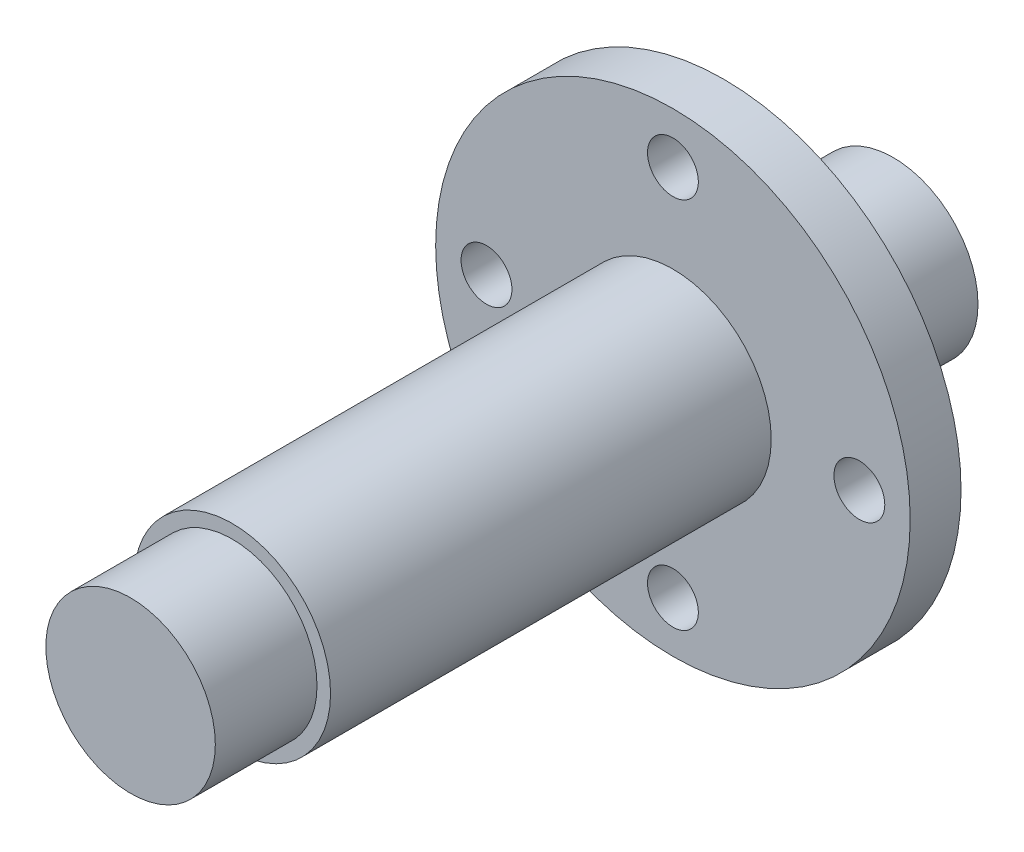
ISO-10303-21;
HEADER;
FILE_DESCRIPTION(('STEP AP214'),'2;1');
FILE_NAME('part.step','',(''),(''),'','','');
FILE_SCHEMA(('AUTOMOTIVE_DESIGN { 1 0 10303 214 1 1 1 1 }'));
ENDSEC;
DATA;
#1=APPLICATION_CONTEXT('core data for automotive mechanical design processes');
#2=APPLICATION_PROTOCOL_DEFINITION('international standard','automotive_design',2000,#1);
#3=PRODUCT_CONTEXT('',#1,'mechanical');
#4=PRODUCT('Part','Part','',(#3));
#5=PRODUCT_RELATED_PRODUCT_CATEGORY('part','',(#4));
#6=PRODUCT_DEFINITION_FORMATION('','',#4);
#7=PRODUCT_DEFINITION_CONTEXT('part definition',#1,'design');
#8=PRODUCT_DEFINITION('design','',#6,#7);
#9=PRODUCT_DEFINITION_SHAPE('','',#8);
#10=(LENGTH_UNIT() NAMED_UNIT(*) SI_UNIT(.MILLI.,.METRE.));
#11=(NAMED_UNIT(*) PLANE_ANGLE_UNIT() SI_UNIT($,.RADIAN.));
#12=(NAMED_UNIT(*) SI_UNIT($,.STERADIAN.) SOLID_ANGLE_UNIT());
#13=UNCERTAINTY_MEASURE_WITH_UNIT(LENGTH_MEASURE(1.E-05),#10,'distance_accuracy_value','');
#14=(GEOMETRIC_REPRESENTATION_CONTEXT(3) GLOBAL_UNCERTAINTY_ASSIGNED_CONTEXT((#13)) GLOBAL_UNIT_ASSIGNED_CONTEXT((#10,
#11,#12)) REPRESENTATION_CONTEXT('',''));
#15=CARTESIAN_POINT('',(0.,0.,0.));
#16=DIRECTION('',(0.,0.,1.));
#17=DIRECTION('',(1.,0.,0.));
#18=AXIS2_PLACEMENT_3D('',#15,#16,#17);
#19=CARTESIAN_POINT('',(0.,0.,6.));
#20=DIRECTION('',(0.,0.,-1.));
#21=DIRECTION('',(-1.,0.,0.));
#22=AXIS2_PLACEMENT_3D('',#19,#20,#21);
#23=CYLINDRICAL_SURFACE('',#22,5.);
#24=CARTESIAN_POINT('',(0.,0.,6.));
#25=DIRECTION('',(0.,0.,1.));
#26=DIRECTION('',(1.,0.,0.));
#27=AXIS2_PLACEMENT_3D('',#24,#25,#26);
#28=CIRCLE('',#27,5.);
#29=CARTESIAN_POINT('',(5.,0.,6.));
#30=VERTEX_POINT('',#29);
#31=EDGE_CURVE('E51',#30,#30,#28,.T.);
#32=ORIENTED_EDGE('',*,*,#31,.F.);
#33=EDGE_LOOP('',(#32));
#34=FACE_BOUND('',#33,.T.);
#35=CARTESIAN_POINT('',(0.,0.,0.));
#36=DIRECTION('',(0.,0.,1.));
#37=DIRECTION('',(1.,0.,0.));
#38=AXIS2_PLACEMENT_3D('',#35,#36,#37);
#39=CIRCLE('',#38,5.);
#40=CARTESIAN_POINT('',(5.,0.,0.));
#41=VERTEX_POINT('',#40);
#42=EDGE_CURVE('E40',#41,#41,#39,.T.);
#43=ORIENTED_EDGE('',*,*,#42,.T.);
#44=EDGE_LOOP('',(#43));
#45=FACE_BOUND('',#44,.T.);
#46=ADVANCED_FACE('F37',(#34,#45),#23,.T.);
#47=CARTESIAN_POINT('',(0.,0.,0.));
#48=DIRECTION('',(0.,0.,1.));
#49=DIRECTION('',(1.,0.,0.));
#50=AXIS2_PLACEMENT_3D('',#47,#48,#49);
#51=PLANE('',#50);
#52=ORIENTED_EDGE('',*,*,#42,.F.);
#53=EDGE_LOOP('',(#52));
#54=FACE_BOUND('',#53,.T.);
#55=ADVANCED_FACE('F85',(#54),#51,.F.);
#56=CARTESIAN_POINT('',(0.,0.,10.));
#57=DIRECTION('',(0.,0.,-1.));
#58=DIRECTION('',(-1.,0.,0.));
#59=AXIS2_PLACEMENT_3D('',#56,#57,#58);
#60=CYLINDRICAL_SURFACE('',#59,5.8);
#61=CARTESIAN_POINT('',(0.,0.,10.));
#62=DIRECTION('',(0.,0.,1.));
#63=DIRECTION('',(1.,0.,0.));
#64=AXIS2_PLACEMENT_3D('',#61,#62,#63);
#65=CIRCLE('',#64,5.8);
#66=CARTESIAN_POINT('',(5.8,0.,10.));
#67=VERTEX_POINT('',#66);
#68=EDGE_CURVE('E70',#67,#67,#65,.T.);
#69=ORIENTED_EDGE('',*,*,#68,.F.);
#70=EDGE_LOOP('',(#69));
#71=FACE_BOUND('',#70,.T.);
#72=CARTESIAN_POINT('',(0.,0.,6.));
#73=DIRECTION('',(0.,0.,1.));
#74=DIRECTION('',(1.,0.,0.));
#75=AXIS2_PLACEMENT_3D('',#72,#73,#74);
#76=CIRCLE('',#75,5.8);
#77=CARTESIAN_POINT('',(5.8,0.,6.));
#78=VERTEX_POINT('',#77);
#79=EDGE_CURVE('E66',#78,#78,#76,.T.);
#80=ORIENTED_EDGE('',*,*,#79,.T.);
#81=EDGE_LOOP('',(#80));
#82=FACE_BOUND('',#81,.T.);
#83=ADVANCED_FACE('F87',(#71,#82),#60,.T.);
#84=CARTESIAN_POINT('',(0.,0.,6.));
#85=DIRECTION('',(0.,0.,1.));
#86=DIRECTION('',(1.,0.,0.));
#87=AXIS2_PLACEMENT_3D('',#84,#85,#86);
#88=PLANE('',#87);
#89=ORIENTED_EDGE('',*,*,#31,.T.);
#90=EDGE_LOOP('',(#89));
#91=FACE_BOUND('',#90,.T.);
#92=ORIENTED_EDGE('',*,*,#79,.F.);
#93=EDGE_LOOP('',(#92));
#94=FACE_BOUND('',#93,.T.);
#95=ADVANCED_FACE('F92',(#91,#94),#88,.F.);
#96=CARTESIAN_POINT('',(0.,0.,13.));
#97=DIRECTION('',(0.,0.,-1.));
#98=DIRECTION('',(-1.,0.,0.));
#99=AXIS2_PLACEMENT_3D('',#96,#97,#98);
#100=CYLINDRICAL_SURFACE('',#99,14.);
#101=CARTESIAN_POINT('',(0.,0.,13.));
#102=DIRECTION('',(0.,0.,1.));
#103=DIRECTION('',(1.,0.,0.));
#104=AXIS2_PLACEMENT_3D('',#101,#102,#103);
#105=CIRCLE('',#104,14.);
#106=CARTESIAN_POINT('',(14.,0.,13.));
#107=VERTEX_POINT('',#106);
#108=EDGE_CURVE('E62',#107,#107,#105,.T.);
#109=ORIENTED_EDGE('',*,*,#108,.F.);
#110=EDGE_LOOP('',(#109));
#111=FACE_BOUND('',#110,.T.);
#112=CARTESIAN_POINT('',(0.,0.,10.));
#113=DIRECTION('',(0.,0.,1.));
#114=DIRECTION('',(1.,0.,0.));
#115=AXIS2_PLACEMENT_3D('',#112,#113,#114);
#116=CIRCLE('',#115,14.);
#117=CARTESIAN_POINT('',(14.,0.,10.));
#118=VERTEX_POINT('',#117);
#119=EDGE_CURVE('E60',#118,#118,#116,.T.);
#120=ORIENTED_EDGE('',*,*,#119,.T.);
#121=EDGE_LOOP('',(#120));
#122=FACE_BOUND('',#121,.T.);
#123=ADVANCED_FACE('F99',(#111,#122),#100,.T.);
#124=CARTESIAN_POINT('',(0.,0.,13.));
#125=DIRECTION('',(0.,0.,1.));
#126=DIRECTION('',(1.,0.,0.));
#127=AXIS2_PLACEMENT_3D('',#124,#125,#126);
#128=PLANE('',#127);
#129=CARTESIAN_POINT('',(-11.,0.,13.));
#130=DIRECTION('',(0.,0.,1.));
#131=DIRECTION('',(1.,0.,0.));
#132=AXIS2_PLACEMENT_3D('',#129,#130,#131);
#133=CIRCLE('',#132,1.5);
#134=CARTESIAN_POINT('',(-9.5,0.,13.));
#135=VERTEX_POINT('',#134);
#136=EDGE_CURVE('E147',#135,#135,#133,.T.);
#137=ORIENTED_EDGE('',*,*,#136,.F.);
#138=EDGE_LOOP('',(#137));
#139=FACE_BOUND('',#138,.T.);
#140=CARTESIAN_POINT('',(0.,-11.,13.));
#141=DIRECTION('',(0.,0.,1.));
#142=DIRECTION('',(1.,0.,0.));
#143=AXIS2_PLACEMENT_3D('',#140,#141,#142);
#144=CIRCLE('',#143,1.5);
#145=CARTESIAN_POINT('',(1.50000000000004,-11.,13.));
#146=VERTEX_POINT('',#145);
#147=EDGE_CURVE('E174',#146,#146,#144,.T.);
#148=ORIENTED_EDGE('',*,*,#147,.F.);
#149=EDGE_LOOP('',(#148));
#150=FACE_BOUND('',#149,.T.);
#151=CARTESIAN_POINT('',(11.,0.,13.));
#152=DIRECTION('',(0.,0.,1.));
#153=DIRECTION('',(1.,0.,0.));
#154=AXIS2_PLACEMENT_3D('',#151,#152,#153);
#155=CIRCLE('',#154,1.5);
#156=CARTESIAN_POINT('',(12.5,0.,13.));
#157=VERTEX_POINT('',#156);
#158=EDGE_CURVE('E158',#157,#157,#155,.T.);
#159=ORIENTED_EDGE('',*,*,#158,.F.);
#160=EDGE_LOOP('',(#159));
#161=FACE_BOUND('',#160,.T.);
#162=CARTESIAN_POINT('',(-1.15218884181823E-13,11.,13.));
#163=DIRECTION('',(0.,0.,1.));
#164=DIRECTION('',(1.,0.,0.));
#165=AXIS2_PLACEMENT_3D('',#162,#163,#164);
#166=CIRCLE('',#165,1.5);
#167=CARTESIAN_POINT('',(1.49999999999989,11.,13.));
#168=VERTEX_POINT('',#167);
#169=EDGE_CURVE('E152',#168,#168,#166,.T.);
#170=ORIENTED_EDGE('',*,*,#169,.F.);
#171=EDGE_LOOP('',(#170));
#172=FACE_BOUND('',#171,.T.);
#173=CARTESIAN_POINT('',(0.,0.,13.));
#174=DIRECTION('',(0.,0.,1.));
#175=DIRECTION('',(1.,0.,0.));
#176=AXIS2_PLACEMENT_3D('',#173,#174,#175);
#177=CIRCLE('',#176,5.8);
#178=CARTESIAN_POINT('',(5.8,0.,13.));
#179=VERTEX_POINT('',#178);
#180=EDGE_CURVE('E45',#179,#179,#177,.T.);
#181=ORIENTED_EDGE('',*,*,#180,.F.);
#182=EDGE_LOOP('',(#181));
#183=FACE_BOUND('',#182,.T.);
#184=ORIENTED_EDGE('',*,*,#108,.T.);
#185=EDGE_LOOP('',(#184));
#186=FACE_BOUND('',#185,.T.);
#187=ADVANCED_FACE('F102',(#139,#150,#161,#172,#183,#186),#128,.T.);
#188=CARTESIAN_POINT('',(0.,0.,10.));
#189=DIRECTION('',(0.,0.,1.));
#190=DIRECTION('',(1.,0.,0.));
#191=AXIS2_PLACEMENT_3D('',#188,#189,#190);
#192=PLANE('',#191);
#193=CARTESIAN_POINT('',(-11.,0.,10.));
#194=DIRECTION('',(0.,0.,-1.));
#195=DIRECTION('',(-1.,0.,0.));
#196=AXIS2_PLACEMENT_3D('',#193,#194,#195);
#197=CIRCLE('',#196,1.5);
#198=CARTESIAN_POINT('',(-12.5,0.,10.));
#199=VERTEX_POINT('',#198);
#200=EDGE_CURVE('E150',#199,#199,#197,.T.);
#201=ORIENTED_EDGE('',*,*,#200,.F.);
#202=EDGE_LOOP('',(#201));
#203=FACE_BOUND('',#202,.T.);
#204=CARTESIAN_POINT('',(0.,-11.,10.));
#205=DIRECTION('',(0.,0.,-1.));
#206=DIRECTION('',(-1.,0.,0.));
#207=AXIS2_PLACEMENT_3D('',#204,#205,#206);
#208=CIRCLE('',#207,1.5);
#209=CARTESIAN_POINT('',(-1.49999999999996,-11.,10.));
#210=VERTEX_POINT('',#209);
#211=EDGE_CURVE('E153',#210,#210,#208,.T.);
#212=ORIENTED_EDGE('',*,*,#211,.F.);
#213=EDGE_LOOP('',(#212));
#214=FACE_BOUND('',#213,.T.);
#215=CARTESIAN_POINT('',(11.,0.,10.));
#216=DIRECTION('',(0.,0.,-1.));
#217=DIRECTION('',(-1.,0.,0.));
#218=AXIS2_PLACEMENT_3D('',#215,#216,#217);
#219=CIRCLE('',#218,1.5);
#220=CARTESIAN_POINT('',(9.5,0.,10.));
#221=VERTEX_POINT('',#220);
#222=EDGE_CURVE('E161',#221,#221,#219,.T.);
#223=ORIENTED_EDGE('',*,*,#222,.F.);
#224=EDGE_LOOP('',(#223));
#225=FACE_BOUND('',#224,.T.);
#226=CARTESIAN_POINT('',(-1.15218884181823E-13,11.,10.));
#227=DIRECTION('',(0.,0.,-1.));
#228=DIRECTION('',(-1.,0.,0.));
#229=AXIS2_PLACEMENT_3D('',#226,#227,#228);
#230=CIRCLE('',#229,1.5);
#231=CARTESIAN_POINT('',(-1.50000000000012,11.,10.));
#232=VERTEX_POINT('',#231);
#233=EDGE_CURVE('E167',#232,#232,#230,.T.);
#234=ORIENTED_EDGE('',*,*,#233,.F.);
#235=EDGE_LOOP('',(#234));
#236=FACE_BOUND('',#235,.T.);
#237=ORIENTED_EDGE('',*,*,#68,.T.);
#238=EDGE_LOOP('',(#237));
#239=FACE_BOUND('',#238,.T.);
#240=ORIENTED_EDGE('',*,*,#119,.F.);
#241=EDGE_LOOP('',(#240));
#242=FACE_BOUND('',#241,.T.);
#243=ADVANCED_FACE('F104',(#203,#214,#225,#236,#239,#242),#192,.F.);
#244=CARTESIAN_POINT('',(0.,0.,39.));
#245=DIRECTION('',(0.,0.,-1.));
#246=DIRECTION('',(-1.,0.,0.));
#247=AXIS2_PLACEMENT_3D('',#244,#245,#246);
#248=CYLINDRICAL_SURFACE('',#247,5.8);
#249=CARTESIAN_POINT('',(0.,0.,39.));
#250=DIRECTION('',(0.,0.,1.));
#251=DIRECTION('',(1.,0.,0.));
#252=AXIS2_PLACEMENT_3D('',#249,#250,#251);
#253=CIRCLE('',#252,5.8);
#254=CARTESIAN_POINT('',(5.8,0.,39.));
#255=VERTEX_POINT('',#254);
#256=EDGE_CURVE('E57',#255,#255,#253,.T.);
#257=ORIENTED_EDGE('',*,*,#256,.F.);
#258=EDGE_LOOP('',(#257));
#259=FACE_BOUND('',#258,.T.);
#260=ORIENTED_EDGE('',*,*,#180,.T.);
#261=EDGE_LOOP('',(#260));
#262=FACE_BOUND('',#261,.T.);
#263=ADVANCED_FACE('F107',(#259,#262),#248,.T.);
#264=CARTESIAN_POINT('',(0.,0.,39.));
#265=DIRECTION('',(0.,0.,1.));
#266=DIRECTION('',(1.,0.,0.));
#267=AXIS2_PLACEMENT_3D('',#264,#265,#266);
#268=PLANE('',#267);
#269=CARTESIAN_POINT('',(0.,0.,39.));
#270=DIRECTION('',(0.,0.,1.));
#271=DIRECTION('',(1.,0.,0.));
#272=AXIS2_PLACEMENT_3D('',#269,#270,#271);
#273=CIRCLE('',#272,5.);
#274=CARTESIAN_POINT('',(5.,0.,39.));
#275=VERTEX_POINT('',#274);
#276=EDGE_CURVE('E10',#275,#275,#273,.T.);
#277=ORIENTED_EDGE('',*,*,#276,.F.);
#278=EDGE_LOOP('',(#277));
#279=FACE_BOUND('',#278,.T.);
#280=ORIENTED_EDGE('',*,*,#256,.T.);
#281=EDGE_LOOP('',(#280));
#282=FACE_BOUND('',#281,.T.);
#283=ADVANCED_FACE('F114',(#279,#282),#268,.T.);
#284=CARTESIAN_POINT('',(0.,0.,45.));
#285=DIRECTION('',(0.,0.,-1.));
#286=DIRECTION('',(-1.,0.,0.));
#287=AXIS2_PLACEMENT_3D('',#284,#285,#286);
#288=CYLINDRICAL_SURFACE('',#287,5.);
#289=CARTESIAN_POINT('',(0.,0.,45.));
#290=DIRECTION('',(0.,0.,1.));
#291=DIRECTION('',(1.,0.,0.));
#292=AXIS2_PLACEMENT_3D('',#289,#290,#291);
#293=CIRCLE('',#292,5.);
#294=CARTESIAN_POINT('',(5.,0.,45.));
#295=VERTEX_POINT('',#294);
#296=EDGE_CURVE('E55',#295,#295,#293,.T.);
#297=ORIENTED_EDGE('',*,*,#296,.F.);
#298=EDGE_LOOP('',(#297));
#299=FACE_BOUND('',#298,.T.);
#300=ORIENTED_EDGE('',*,*,#276,.T.);
#301=EDGE_LOOP('',(#300));
#302=FACE_BOUND('',#301,.T.);
#303=ADVANCED_FACE('F118',(#299,#302),#288,.T.);
#304=CARTESIAN_POINT('',(0.,0.,45.));
#305=DIRECTION('',(0.,0.,1.));
#306=DIRECTION('',(1.,0.,0.));
#307=AXIS2_PLACEMENT_3D('',#304,#305,#306);
#308=PLANE('',#307);
#309=ORIENTED_EDGE('',*,*,#296,.T.);
#310=EDGE_LOOP('',(#309));
#311=FACE_BOUND('',#310,.T.);
#312=ADVANCED_FACE('F122',(#311),#308,.T.);
#313=CARTESIAN_POINT('',(-1.15218884181823E-13,11.,16.));
#314=DIRECTION('',(0.,0.,-1.));
#315=DIRECTION('',(-1.,0.,0.));
#316=AXIS2_PLACEMENT_3D('',#313,#314,#315);
#317=CYLINDRICAL_SURFACE('',#316,1.5);
#318=ORIENTED_EDGE('',*,*,#169,.T.);
#319=EDGE_LOOP('',(#318));
#320=FACE_BOUND('',#319,.T.);
#321=ORIENTED_EDGE('',*,*,#233,.T.);
#322=EDGE_LOOP('',(#321));
#323=FACE_BOUND('',#322,.T.);
#324=ADVANCED_FACE('F126',(#320,#323),#317,.F.);
#325=CARTESIAN_POINT('',(11.,0.,16.));
#326=DIRECTION('',(0.,0.,-1.));
#327=DIRECTION('',(-1.,0.,0.));
#328=AXIS2_PLACEMENT_3D('',#325,#326,#327);
#329=CYLINDRICAL_SURFACE('',#328,1.5);
#330=ORIENTED_EDGE('',*,*,#158,.T.);
#331=EDGE_LOOP('',(#330));
#332=FACE_BOUND('',#331,.T.);
#333=ORIENTED_EDGE('',*,*,#222,.T.);
#334=EDGE_LOOP('',(#333));
#335=FACE_BOUND('',#334,.T.);
#336=ADVANCED_FACE('F130',(#332,#335),#329,.F.);
#337=CARTESIAN_POINT('',(0.,-11.,16.));
#338=DIRECTION('',(0.,0.,-1.));
#339=DIRECTION('',(-1.,0.,0.));
#340=AXIS2_PLACEMENT_3D('',#337,#338,#339);
#341=CYLINDRICAL_SURFACE('',#340,1.5);
#342=ORIENTED_EDGE('',*,*,#147,.T.);
#343=EDGE_LOOP('',(#342));
#344=FACE_BOUND('',#343,.T.);
#345=ORIENTED_EDGE('',*,*,#211,.T.);
#346=EDGE_LOOP('',(#345));
#347=FACE_BOUND('',#346,.T.);
#348=ADVANCED_FACE('F134',(#344,#347),#341,.F.);
#349=CARTESIAN_POINT('',(-11.,0.,16.));
#350=DIRECTION('',(0.,0.,-1.));
#351=DIRECTION('',(-1.,0.,0.));
#352=AXIS2_PLACEMENT_3D('',#349,#350,#351);
#353=CYLINDRICAL_SURFACE('',#352,1.5);
#354=ORIENTED_EDGE('',*,*,#136,.T.);
#355=EDGE_LOOP('',(#354));
#356=FACE_BOUND('',#355,.T.);
#357=ORIENTED_EDGE('',*,*,#200,.T.);
#358=EDGE_LOOP('',(#357));
#359=FACE_BOUND('',#358,.T.);
#360=ADVANCED_FACE('F138',(#356,#359),#353,.F.);
#361=CLOSED_SHELL('',(#46,#55,#83,#95,#123,#187,#243,#263,#283,#303,#312,#324,#336,#348,#360));
#362=MANIFOLD_SOLID_BREP('B2',#361);
#363=ADVANCED_BREP_SHAPE_REPRESENTATION('',(#18,#362),#14);
#364=SHAPE_DEFINITION_REPRESENTATION(#9,#363);
ENDSEC;
END-ISO-10303-21;
